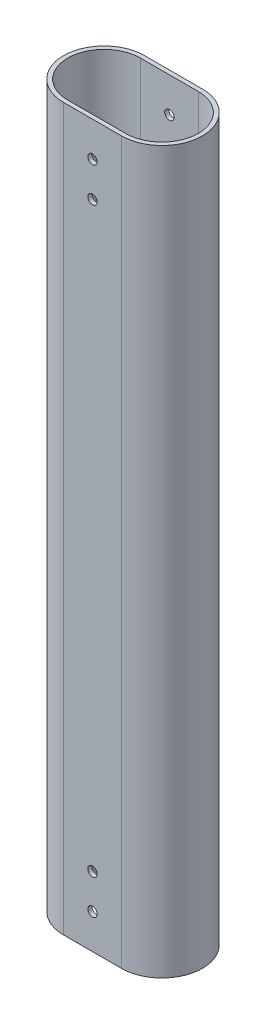
ISO-10303-21;
HEADER;
FILE_DESCRIPTION(('STEP AP214'),'2;1');
FILE_NAME('part.step','',(''),(''),'','','');
FILE_SCHEMA(('AUTOMOTIVE_DESIGN { 1 0 10303 214 1 1 1 1 }'));
ENDSEC;
DATA;
#1=APPLICATION_CONTEXT('core data for automotive mechanical design processes');
#2=APPLICATION_PROTOCOL_DEFINITION('international standard','automotive_design',2000,#1);
#3=PRODUCT_CONTEXT('',#1,'mechanical');
#4=PRODUCT('Part','Part','',(#3));
#5=PRODUCT_RELATED_PRODUCT_CATEGORY('part','',(#4));
#6=PRODUCT_DEFINITION_FORMATION('','',#4);
#7=PRODUCT_DEFINITION_CONTEXT('part definition',#1,'design');
#8=PRODUCT_DEFINITION('design','',#6,#7);
#9=PRODUCT_DEFINITION_SHAPE('','',#8);
#10=(LENGTH_UNIT() NAMED_UNIT(*) SI_UNIT(.MILLI.,.METRE.));
#11=(NAMED_UNIT(*) PLANE_ANGLE_UNIT() SI_UNIT($,.RADIAN.));
#12=(NAMED_UNIT(*) SI_UNIT($,.STERADIAN.) SOLID_ANGLE_UNIT());
#13=UNCERTAINTY_MEASURE_WITH_UNIT(LENGTH_MEASURE(1.E-05),#10,'distance_accuracy_value','');
#14=(GEOMETRIC_REPRESENTATION_CONTEXT(3) GLOBAL_UNCERTAINTY_ASSIGNED_CONTEXT((#13)) GLOBAL_UNIT_ASSIGNED_CONTEXT((#10,
#11,#12)) REPRESENTATION_CONTEXT('',''));
#15=CARTESIAN_POINT('',(0.,0.,0.));
#16=DIRECTION('',(0.,0.,1.));
#17=DIRECTION('',(1.,0.,0.));
#18=AXIS2_PLACEMENT_3D('',#15,#16,#17);
#19=CARTESIAN_POINT('',(12.5,311.4,0.));
#20=DIRECTION('',(0.,1.,0.));
#21=DIRECTION('',(0.,0.,1.));
#22=AXIS2_PLACEMENT_3D('',#19,#20,#21);
#23=PLANE('',#22);
#24=CARTESIAN_POINT('',(12.5,311.4,0.));
#25=DIRECTION('',(0.,1.,0.));
#26=DIRECTION('',(0.,0.,1.));
#27=AXIS2_PLACEMENT_3D('',#24,#25,#26);
#28=CIRCLE('',#27,17.5);
#29=CARTESIAN_POINT('',(12.5,311.4,17.5));
#30=VERTEX_POINT('',#29);
#31=CARTESIAN_POINT('',(12.5,311.4,-17.5));
#32=VERTEX_POINT('',#31);
#33=EDGE_CURVE('E139',#30,#32,#28,.T.);
#34=ORIENTED_EDGE('',*,*,#33,.T.);
#35=DIRECTION('',(-1.,0.,0.));
#36=VECTOR('',#35,1.);
#37=CARTESIAN_POINT('',(-12.5,311.4,-17.5));
#38=LINE('',#37,#36);
#39=CARTESIAN_POINT('',(-12.5,311.4,-17.5));
#40=VERTEX_POINT('',#39);
#41=EDGE_CURVE('E142',#32,#40,#38,.T.);
#42=ORIENTED_EDGE('',*,*,#41,.T.);
#43=CARTESIAN_POINT('',(-12.5,311.4,0.));
#44=DIRECTION('',(0.,1.,0.));
#45=DIRECTION('',(0.,0.,1.));
#46=AXIS2_PLACEMENT_3D('',#43,#44,#45);
#47=CIRCLE('',#46,17.5);
#48=CARTESIAN_POINT('',(-12.5,311.4,17.5));
#49=VERTEX_POINT('',#48);
#50=EDGE_CURVE('E145',#40,#49,#47,.T.);
#51=ORIENTED_EDGE('',*,*,#50,.T.);
#52=DIRECTION('',(1.,0.,0.));
#53=VECTOR('',#52,1.);
#54=CARTESIAN_POINT('',(-12.5,311.4,17.5));
#55=LINE('',#54,#53);
#56=EDGE_CURVE('E147',#49,#30,#55,.T.);
#57=ORIENTED_EDGE('',*,*,#56,.T.);
#58=EDGE_LOOP('',(#34,#42,#51,#57));
#59=FACE_BOUND('',#58,.T.);
#60=DIRECTION('',(1.,0.,0.));
#61=VECTOR('',#60,1.);
#62=CARTESIAN_POINT('',(-12.5,311.4,15.7));
#63=LINE('',#62,#61);
#64=CARTESIAN_POINT('',(-12.5,311.4,15.7));
#65=VERTEX_POINT('',#64);
#66=CARTESIAN_POINT('',(12.5,311.4,15.7));
#67=VERTEX_POINT('',#66);
#68=EDGE_CURVE('E109',#65,#67,#63,.T.);
#69=ORIENTED_EDGE('',*,*,#68,.F.);
#70=CARTESIAN_POINT('',(-12.5,311.4,0.));
#71=DIRECTION('',(0.,1.,0.));
#72=DIRECTION('',(0.,0.,1.));
#73=AXIS2_PLACEMENT_3D('',#70,#71,#72);
#74=CIRCLE('',#73,15.7);
#75=CARTESIAN_POINT('',(-12.5,311.4,-15.7));
#76=VERTEX_POINT('',#75);
#77=EDGE_CURVE('E101',#76,#65,#74,.T.);
#78=ORIENTED_EDGE('',*,*,#77,.F.);
#79=DIRECTION('',(-1.,0.,0.));
#80=VECTOR('',#79,1.);
#81=CARTESIAN_POINT('',(-12.5,311.4,-15.7));
#82=LINE('',#81,#80);
#83=CARTESIAN_POINT('',(12.5,311.4,-15.7));
#84=VERTEX_POINT('',#83);
#85=EDGE_CURVE('E123',#84,#76,#82,.T.);
#86=ORIENTED_EDGE('',*,*,#85,.F.);
#87=CARTESIAN_POINT('',(12.5,311.4,0.));
#88=DIRECTION('',(0.,1.,0.));
#89=DIRECTION('',(0.,0.,1.));
#90=AXIS2_PLACEMENT_3D('',#87,#88,#89);
#91=CIRCLE('',#90,15.7);
#92=EDGE_CURVE('E121',#67,#84,#91,.T.);
#93=ORIENTED_EDGE('',*,*,#92,.F.);
#94=EDGE_LOOP('',(#69,#78,#86,#93));
#95=FACE_BOUND('',#94,.T.);
#96=ADVANCED_FACE('F34',(#59,#95),#23,.T.);
#97=CARTESIAN_POINT('',(12.5,0.,0.));
#98=DIRECTION('',(0.,1.,0.));
#99=DIRECTION('',(0.,0.,1.));
#100=AXIS2_PLACEMENT_3D('',#97,#98,#99);
#101=PLANE('',#100);
#102=CARTESIAN_POINT('',(12.5,0.,0.));
#103=DIRECTION('',(0.,1.,0.));
#104=DIRECTION('',(0.,0.,1.));
#105=AXIS2_PLACEMENT_3D('',#102,#103,#104);
#106=CIRCLE('',#105,17.5);
#107=CARTESIAN_POINT('',(12.5,0.,17.5));
#108=VERTEX_POINT('',#107);
#109=CARTESIAN_POINT('',(12.5,0.,-17.5));
#110=VERTEX_POINT('',#109);
#111=EDGE_CURVE('E117',#108,#110,#106,.T.);
#112=ORIENTED_EDGE('',*,*,#111,.F.);
#113=DIRECTION('',(1.,0.,0.));
#114=VECTOR('',#113,1.);
#115=CARTESIAN_POINT('',(-12.5,0.,17.5));
#116=LINE('',#115,#114);
#117=CARTESIAN_POINT('',(-12.5,0.,17.5));
#118=VERTEX_POINT('',#117);
#119=EDGE_CURVE('E143',#118,#108,#116,.T.);
#120=ORIENTED_EDGE('',*,*,#119,.F.);
#121=CARTESIAN_POINT('',(-12.5,0.,0.));
#122=DIRECTION('',(0.,1.,0.));
#123=DIRECTION('',(0.,0.,1.));
#124=AXIS2_PLACEMENT_3D('',#121,#122,#123);
#125=CIRCLE('',#124,17.5);
#126=CARTESIAN_POINT('',(-12.5,0.,-17.5));
#127=VERTEX_POINT('',#126);
#128=EDGE_CURVE('E154',#127,#118,#125,.T.);
#129=ORIENTED_EDGE('',*,*,#128,.F.);
#130=DIRECTION('',(-1.,0.,0.));
#131=VECTOR('',#130,1.);
#132=CARTESIAN_POINT('',(-12.5,0.,-17.5));
#133=LINE('',#132,#131);
#134=EDGE_CURVE('E152',#110,#127,#133,.T.);
#135=ORIENTED_EDGE('',*,*,#134,.F.);
#136=EDGE_LOOP('',(#112,#120,#129,#135));
#137=FACE_BOUND('',#136,.T.);
#138=CARTESIAN_POINT('',(-12.5,0.,0.));
#139=DIRECTION('',(0.,1.,0.));
#140=DIRECTION('',(0.,0.,1.));
#141=AXIS2_PLACEMENT_3D('',#138,#139,#140);
#142=CIRCLE('',#141,15.7);
#143=CARTESIAN_POINT('',(-12.5,0.,-15.7));
#144=VERTEX_POINT('',#143);
#145=CARTESIAN_POINT('',(-12.5,0.,15.7));
#146=VERTEX_POINT('',#145);
#147=EDGE_CURVE('E59',#144,#146,#142,.T.);
#148=ORIENTED_EDGE('',*,*,#147,.T.);
#149=DIRECTION('',(1.,0.,0.));
#150=VECTOR('',#149,1.);
#151=CARTESIAN_POINT('',(-12.5,0.,15.7));
#152=LINE('',#151,#150);
#153=CARTESIAN_POINT('',(12.5,0.,15.7));
#154=VERTEX_POINT('',#153);
#155=EDGE_CURVE('E116',#146,#154,#152,.T.);
#156=ORIENTED_EDGE('',*,*,#155,.T.);
#157=CARTESIAN_POINT('',(12.5,0.,0.));
#158=DIRECTION('',(0.,1.,0.));
#159=DIRECTION('',(0.,0.,1.));
#160=AXIS2_PLACEMENT_3D('',#157,#158,#159);
#161=CIRCLE('',#160,15.7);
#162=CARTESIAN_POINT('',(12.5,0.,-15.7));
#163=VERTEX_POINT('',#162);
#164=EDGE_CURVE('E131',#154,#163,#161,.T.);
#165=ORIENTED_EDGE('',*,*,#164,.T.);
#166=DIRECTION('',(-1.,0.,0.));
#167=VECTOR('',#166,1.);
#168=CARTESIAN_POINT('',(-12.5,0.,-15.7));
#169=LINE('',#168,#167);
#170=EDGE_CURVE('E110',#163,#144,#169,.T.);
#171=ORIENTED_EDGE('',*,*,#170,.T.);
#172=EDGE_LOOP('',(#148,#156,#165,#171));
#173=FACE_BOUND('',#172,.T.);
#174=ADVANCED_FACE('F223',(#137,#173),#101,.F.);
#175=CARTESIAN_POINT('',(12.5,311.4,0.));
#176=DIRECTION('',(0.,-1.,0.));
#177=DIRECTION('',(0.,0.,-1.));
#178=AXIS2_PLACEMENT_3D('',#175,#176,#177);
#179=CYLINDRICAL_SURFACE('',#178,17.5);
#180=ORIENTED_EDGE('',*,*,#111,.T.);
#181=DIRECTION('',(0.,-1.,0.));
#182=VECTOR('',#181,1.);
#183=CARTESIAN_POINT('',(12.5,311.4,-17.5));
#184=LINE('',#183,#182);
#185=EDGE_CURVE('E11',#32,#110,#184,.T.);
#186=ORIENTED_EDGE('',*,*,#185,.F.);
#187=ORIENTED_EDGE('',*,*,#33,.F.);
#188=DIRECTION('',(0.,-1.,0.));
#189=VECTOR('',#188,1.);
#190=CARTESIAN_POINT('',(12.5,311.4,17.5));
#191=LINE('',#190,#189);
#192=EDGE_CURVE('E149',#30,#108,#191,.T.);
#193=ORIENTED_EDGE('',*,*,#192,.T.);
#194=EDGE_LOOP('',(#180,#186,#187,#193));
#195=FACE_BOUND('',#194,.T.);
#196=ADVANCED_FACE('F36',(#195),#179,.T.);
#197=CARTESIAN_POINT('',(-12.5,311.4,-17.5));
#198=DIRECTION('',(0.,0.,1.));
#199=DIRECTION('',(1.,0.,0.));
#200=AXIS2_PLACEMENT_3D('',#197,#198,#199);
#201=PLANE('',#200);
#202=CARTESIAN_POINT('',(0.,15.,-17.5));
#203=DIRECTION('',(0.,0.,1.));
#204=DIRECTION('',(1.,0.,0.));
#205=AXIS2_PLACEMENT_3D('',#202,#203,#204);
#206=CIRCLE('',#205,2.01929999999999);
#207=CARTESIAN_POINT('',(2.01929999999999,15.,-17.5));
#208=VERTEX_POINT('',#207);
#209=EDGE_CURVE('E247',#208,#208,#206,.T.);
#210=ORIENTED_EDGE('',*,*,#209,.T.);
#211=EDGE_LOOP('',(#210));
#212=FACE_BOUND('',#211,.T.);
#213=CARTESIAN_POINT('',(0.,30.,-17.5));
#214=DIRECTION('',(0.,0.,1.));
#215=DIRECTION('',(1.,0.,0.));
#216=AXIS2_PLACEMENT_3D('',#213,#214,#215);
#217=CIRCLE('',#216,2.01929999999999);
#218=CARTESIAN_POINT('',(2.01929999999999,30.,-17.5));
#219=VERTEX_POINT('',#218);
#220=EDGE_CURVE('E175',#219,#219,#217,.T.);
#221=ORIENTED_EDGE('',*,*,#220,.T.);
#222=EDGE_LOOP('',(#221));
#223=FACE_BOUND('',#222,.T.);
#224=CARTESIAN_POINT('',(0.,296.4,-17.5));
#225=DIRECTION('',(0.,0.,1.));
#226=DIRECTION('',(1.,0.,0.));
#227=AXIS2_PLACEMENT_3D('',#224,#225,#226);
#228=CIRCLE('',#227,2.01929999999999);
#229=CARTESIAN_POINT('',(2.01929999999999,296.4,-17.5));
#230=VERTEX_POINT('',#229);
#231=EDGE_CURVE('E171',#230,#230,#228,.T.);
#232=ORIENTED_EDGE('',*,*,#231,.T.);
#233=EDGE_LOOP('',(#232));
#234=FACE_BOUND('',#233,.T.);
#235=CARTESIAN_POINT('',(0.,281.4,-17.5));
#236=DIRECTION('',(0.,0.,1.));
#237=DIRECTION('',(1.,0.,0.));
#238=AXIS2_PLACEMENT_3D('',#235,#236,#237);
#239=CIRCLE('',#238,2.01929999999999);
#240=CARTESIAN_POINT('',(2.01929999999999,281.4,-17.5));
#241=VERTEX_POINT('',#240);
#242=EDGE_CURVE('E167',#241,#241,#239,.T.);
#243=ORIENTED_EDGE('',*,*,#242,.T.);
#244=EDGE_LOOP('',(#243));
#245=FACE_BOUND('',#244,.T.);
#246=ORIENTED_EDGE('',*,*,#134,.T.);
#247=DIRECTION('',(0.,-1.,0.));
#248=VECTOR('',#247,1.);
#249=CARTESIAN_POINT('',(-12.5,311.4,-17.5));
#250=LINE('',#249,#248);
#251=EDGE_CURVE('E43',#40,#127,#250,.T.);
#252=ORIENTED_EDGE('',*,*,#251,.F.);
#253=ORIENTED_EDGE('',*,*,#41,.F.);
#254=ORIENTED_EDGE('',*,*,#185,.T.);
#255=EDGE_LOOP('',(#246,#252,#253,#254));
#256=FACE_BOUND('',#255,.T.);
#257=ADVANCED_FACE('F237',(#212,#223,#234,#245,#256),#201,.F.);
#258=CARTESIAN_POINT('',(-12.5,311.4,0.));
#259=DIRECTION('',(0.,-1.,0.));
#260=DIRECTION('',(0.,0.,-1.));
#261=AXIS2_PLACEMENT_3D('',#258,#259,#260);
#262=CYLINDRICAL_SURFACE('',#261,17.5);
#263=ORIENTED_EDGE('',*,*,#128,.T.);
#264=DIRECTION('',(0.,-1.,0.));
#265=VECTOR('',#264,1.);
#266=CARTESIAN_POINT('',(-12.5,311.4,17.5));
#267=LINE('',#266,#265);
#268=EDGE_CURVE('E159',#49,#118,#267,.T.);
#269=ORIENTED_EDGE('',*,*,#268,.F.);
#270=ORIENTED_EDGE('',*,*,#50,.F.);
#271=ORIENTED_EDGE('',*,*,#251,.T.);
#272=EDGE_LOOP('',(#263,#269,#270,#271));
#273=FACE_BOUND('',#272,.T.);
#274=ADVANCED_FACE('F234',(#273),#262,.T.);
#275=CARTESIAN_POINT('',(-12.5,311.4,17.5));
#276=DIRECTION('',(0.,0.,-1.));
#277=DIRECTION('',(-1.,0.,0.));
#278=AXIS2_PLACEMENT_3D('',#275,#276,#277);
#279=PLANE('',#278);
#280=CARTESIAN_POINT('',(0.,15.,17.5));
#281=DIRECTION('',(0.,0.,1.));
#282=DIRECTION('',(1.,0.,0.));
#283=AXIS2_PLACEMENT_3D('',#280,#281,#282);
#284=CIRCLE('',#283,2.01929999999999);
#285=CARTESIAN_POINT('',(2.01929999999999,15.,17.5));
#286=VERTEX_POINT('',#285);
#287=EDGE_CURVE('E299',#286,#286,#284,.T.);
#288=ORIENTED_EDGE('',*,*,#287,.F.);
#289=EDGE_LOOP('',(#288));
#290=FACE_BOUND('',#289,.T.);
#291=CARTESIAN_POINT('',(0.,30.,17.5));
#292=DIRECTION('',(0.,0.,1.));
#293=DIRECTION('',(1.,0.,0.));
#294=AXIS2_PLACEMENT_3D('',#291,#292,#293);
#295=CIRCLE('',#294,2.01929999999999);
#296=CARTESIAN_POINT('',(2.01929999999999,30.,17.5));
#297=VERTEX_POINT('',#296);
#298=EDGE_CURVE('E182',#297,#297,#295,.T.);
#299=ORIENTED_EDGE('',*,*,#298,.F.);
#300=EDGE_LOOP('',(#299));
#301=FACE_BOUND('',#300,.T.);
#302=CARTESIAN_POINT('',(0.,296.4,17.5));
#303=DIRECTION('',(0.,0.,1.));
#304=DIRECTION('',(1.,0.,0.));
#305=AXIS2_PLACEMENT_3D('',#302,#303,#304);
#306=CIRCLE('',#305,2.01929999999999);
#307=CARTESIAN_POINT('',(2.01929999999999,296.4,17.5));
#308=VERTEX_POINT('',#307);
#309=EDGE_CURVE('E179',#308,#308,#306,.T.);
#310=ORIENTED_EDGE('',*,*,#309,.F.);
#311=EDGE_LOOP('',(#310));
#312=FACE_BOUND('',#311,.T.);
#313=CARTESIAN_POINT('',(0.,281.4,17.5));
#314=DIRECTION('',(0.,0.,1.));
#315=DIRECTION('',(1.,0.,0.));
#316=AXIS2_PLACEMENT_3D('',#313,#314,#315);
#317=CIRCLE('',#316,2.01929999999999);
#318=CARTESIAN_POINT('',(2.01929999999999,281.4,17.5));
#319=VERTEX_POINT('',#318);
#320=EDGE_CURVE('E197',#319,#319,#317,.T.);
#321=ORIENTED_EDGE('',*,*,#320,.F.);
#322=EDGE_LOOP('',(#321));
#323=FACE_BOUND('',#322,.T.);
#324=ORIENTED_EDGE('',*,*,#119,.T.);
#325=ORIENTED_EDGE('',*,*,#192,.F.);
#326=ORIENTED_EDGE('',*,*,#56,.F.);
#327=ORIENTED_EDGE('',*,*,#268,.T.);
#328=EDGE_LOOP('',(#324,#325,#326,#327));
#329=FACE_BOUND('',#328,.T.);
#330=ADVANCED_FACE('F218',(#290,#301,#312,#323,#329),#279,.F.);
#331=CARTESIAN_POINT('',(-12.5,311.4,0.));
#332=DIRECTION('',(0.,-1.,0.));
#333=DIRECTION('',(0.,0.,-1.));
#334=AXIS2_PLACEMENT_3D('',#331,#332,#333);
#335=CYLINDRICAL_SURFACE('',#334,15.7);
#336=ORIENTED_EDGE('',*,*,#147,.F.);
#337=DIRECTION('',(0.,-1.,0.));
#338=VECTOR('',#337,1.);
#339=CARTESIAN_POINT('',(-12.5,311.4,-15.7));
#340=LINE('',#339,#338);
#341=EDGE_CURVE('E105',#76,#144,#340,.T.);
#342=ORIENTED_EDGE('',*,*,#341,.F.);
#343=ORIENTED_EDGE('',*,*,#77,.T.);
#344=DIRECTION('',(0.,-1.,0.));
#345=VECTOR('',#344,1.);
#346=CARTESIAN_POINT('',(-12.5,311.4,15.7));
#347=LINE('',#346,#345);
#348=EDGE_CURVE('E104',#65,#146,#347,.T.);
#349=ORIENTED_EDGE('',*,*,#348,.T.);
#350=EDGE_LOOP('',(#336,#342,#343,#349));
#351=FACE_BOUND('',#350,.T.);
#352=ADVANCED_FACE('F103',(#351),#335,.F.);
#353=CARTESIAN_POINT('',(-12.5,311.4,15.7));
#354=DIRECTION('',(0.,0.,-1.));
#355=DIRECTION('',(-1.,0.,0.));
#356=AXIS2_PLACEMENT_3D('',#353,#354,#355);
#357=PLANE('',#356);
#358=CARTESIAN_POINT('',(0.,15.,15.7));
#359=DIRECTION('',(0.,0.,-1.));
#360=DIRECTION('',(-1.,0.,0.));
#361=AXIS2_PLACEMENT_3D('',#358,#359,#360);
#362=CIRCLE('',#361,2.01929999999999);
#363=CARTESIAN_POINT('',(-2.01929999999999,15.,15.7));
#364=VERTEX_POINT('',#363);
#365=EDGE_CURVE('E187',#364,#364,#362,.T.);
#366=ORIENTED_EDGE('',*,*,#365,.F.);
#367=EDGE_LOOP('',(#366));
#368=FACE_BOUND('',#367,.T.);
#369=CARTESIAN_POINT('',(0.,30.,15.7));
#370=DIRECTION('',(0.,0.,-1.));
#371=DIRECTION('',(-1.,0.,0.));
#372=AXIS2_PLACEMENT_3D('',#369,#370,#371);
#373=CIRCLE('',#372,2.01929999999999);
#374=CARTESIAN_POINT('',(-2.01929999999999,30.,15.7));
#375=VERTEX_POINT('',#374);
#376=EDGE_CURVE('E174',#375,#375,#373,.T.);
#377=ORIENTED_EDGE('',*,*,#376,.F.);
#378=EDGE_LOOP('',(#377));
#379=FACE_BOUND('',#378,.T.);
#380=CARTESIAN_POINT('',(0.,296.4,15.7));
#381=DIRECTION('',(0.,0.,-1.));
#382=DIRECTION('',(-1.,0.,0.));
#383=AXIS2_PLACEMENT_3D('',#380,#381,#382);
#384=CIRCLE('',#383,2.01929999999999);
#385=CARTESIAN_POINT('',(-2.01929999999999,296.4,15.7));
#386=VERTEX_POINT('',#385);
#387=EDGE_CURVE('E170',#386,#386,#384,.T.);
#388=ORIENTED_EDGE('',*,*,#387,.F.);
#389=EDGE_LOOP('',(#388));
#390=FACE_BOUND('',#389,.T.);
#391=CARTESIAN_POINT('',(0.,281.4,15.7));
#392=DIRECTION('',(0.,0.,-1.));
#393=DIRECTION('',(-1.,0.,0.));
#394=AXIS2_PLACEMENT_3D('',#391,#392,#393);
#395=CIRCLE('',#394,2.01929999999999);
#396=CARTESIAN_POINT('',(-2.01929999999999,281.4,15.7));
#397=VERTEX_POINT('',#396);
#398=EDGE_CURVE('E129',#397,#397,#395,.T.);
#399=ORIENTED_EDGE('',*,*,#398,.F.);
#400=EDGE_LOOP('',(#399));
#401=FACE_BOUND('',#400,.T.);
#402=ORIENTED_EDGE('',*,*,#155,.F.);
#403=ORIENTED_EDGE('',*,*,#348,.F.);
#404=ORIENTED_EDGE('',*,*,#68,.T.);
#405=DIRECTION('',(0.,-1.,0.));
#406=VECTOR('',#405,1.);
#407=CARTESIAN_POINT('',(12.5,311.4,15.7));
#408=LINE('',#407,#406);
#409=EDGE_CURVE('E118',#67,#154,#408,.T.);
#410=ORIENTED_EDGE('',*,*,#409,.T.);
#411=EDGE_LOOP('',(#402,#403,#404,#410));
#412=FACE_BOUND('',#411,.T.);
#413=ADVANCED_FACE('F113',(#368,#379,#390,#401,#412),#357,.T.);
#414=CARTESIAN_POINT('',(12.5,311.4,0.));
#415=DIRECTION('',(0.,-1.,0.));
#416=DIRECTION('',(0.,0.,-1.));
#417=AXIS2_PLACEMENT_3D('',#414,#415,#416);
#418=CYLINDRICAL_SURFACE('',#417,15.7);
#419=ORIENTED_EDGE('',*,*,#164,.F.);
#420=ORIENTED_EDGE('',*,*,#409,.F.);
#421=ORIENTED_EDGE('',*,*,#92,.T.);
#422=DIRECTION('',(0.,-1.,0.));
#423=VECTOR('',#422,1.);
#424=CARTESIAN_POINT('',(12.5,311.4,-15.7));
#425=LINE('',#424,#423);
#426=EDGE_CURVE('E51',#84,#163,#425,.T.);
#427=ORIENTED_EDGE('',*,*,#426,.T.);
#428=EDGE_LOOP('',(#419,#420,#421,#427));
#429=FACE_BOUND('',#428,.T.);
#430=ADVANCED_FACE('F208',(#429),#418,.F.);
#431=CARTESIAN_POINT('',(-12.5,311.4,-15.7));
#432=DIRECTION('',(0.,0.,1.));
#433=DIRECTION('',(1.,0.,0.));
#434=AXIS2_PLACEMENT_3D('',#431,#432,#433);
#435=PLANE('',#434);
#436=CARTESIAN_POINT('',(0.,15.,-15.7));
#437=DIRECTION('',(0.,0.,1.));
#438=DIRECTION('',(1.,0.,0.));
#439=AXIS2_PLACEMENT_3D('',#436,#437,#438);
#440=CIRCLE('',#439,2.01929999999999);
#441=CARTESIAN_POINT('',(2.01929999999999,15.,-15.7));
#442=VERTEX_POINT('',#441);
#443=EDGE_CURVE('E38',#442,#442,#440,.T.);
#444=ORIENTED_EDGE('',*,*,#443,.F.);
#445=EDGE_LOOP('',(#444));
#446=FACE_BOUND('',#445,.T.);
#447=CARTESIAN_POINT('',(0.,30.,-15.7));
#448=DIRECTION('',(0.,0.,1.));
#449=DIRECTION('',(1.,0.,0.));
#450=AXIS2_PLACEMENT_3D('',#447,#448,#449);
#451=CIRCLE('',#450,2.01929999999999);
#452=CARTESIAN_POINT('',(2.01929999999999,30.,-15.7));
#453=VERTEX_POINT('',#452);
#454=EDGE_CURVE('E172',#453,#453,#451,.T.);
#455=ORIENTED_EDGE('',*,*,#454,.F.);
#456=EDGE_LOOP('',(#455));
#457=FACE_BOUND('',#456,.T.);
#458=CARTESIAN_POINT('',(0.,296.4,-15.7));
#459=DIRECTION('',(0.,0.,1.));
#460=DIRECTION('',(1.,0.,0.));
#461=AXIS2_PLACEMENT_3D('',#458,#459,#460);
#462=CIRCLE('',#461,2.01929999999999);
#463=CARTESIAN_POINT('',(2.01929999999999,296.4,-15.7));
#464=VERTEX_POINT('',#463);
#465=EDGE_CURVE('E168',#464,#464,#462,.T.);
#466=ORIENTED_EDGE('',*,*,#465,.F.);
#467=EDGE_LOOP('',(#466));
#468=FACE_BOUND('',#467,.T.);
#469=CARTESIAN_POINT('',(0.,281.4,-15.7));
#470=DIRECTION('',(0.,0.,1.));
#471=DIRECTION('',(1.,0.,0.));
#472=AXIS2_PLACEMENT_3D('',#469,#470,#471);
#473=CIRCLE('',#472,2.01929999999999);
#474=CARTESIAN_POINT('',(2.01929999999999,281.4,-15.7));
#475=VERTEX_POINT('',#474);
#476=EDGE_CURVE('E164',#475,#475,#473,.T.);
#477=ORIENTED_EDGE('',*,*,#476,.F.);
#478=EDGE_LOOP('',(#477));
#479=FACE_BOUND('',#478,.T.);
#480=ORIENTED_EDGE('',*,*,#170,.F.);
#481=ORIENTED_EDGE('',*,*,#426,.F.);
#482=ORIENTED_EDGE('',*,*,#85,.T.);
#483=ORIENTED_EDGE('',*,*,#341,.T.);
#484=EDGE_LOOP('',(#480,#481,#482,#483));
#485=FACE_BOUND('',#484,.T.);
#486=ADVANCED_FACE('F215',(#446,#457,#468,#479,#485),#435,.T.);
#487=CARTESIAN_POINT('',(0.,281.4,17.5));
#488=DIRECTION('',(0.,0.,1.));
#489=DIRECTION('',(1.,0.,0.));
#490=AXIS2_PLACEMENT_3D('',#487,#488,#489);
#491=CYLINDRICAL_SURFACE('',#490,2.01929999999999);
#492=ORIENTED_EDGE('',*,*,#476,.T.);
#493=EDGE_LOOP('',(#492));
#494=FACE_BOUND('',#493,.T.);
#495=ORIENTED_EDGE('',*,*,#242,.F.);
#496=EDGE_LOOP('',(#495));
#497=FACE_BOUND('',#496,.T.);
#498=ADVANCED_FACE('F267',(#494,#497),#491,.F.);
#499=ORIENTED_EDGE('',*,*,#398,.T.);
#500=EDGE_LOOP('',(#499));
#501=FACE_BOUND('',#500,.T.);
#502=ORIENTED_EDGE('',*,*,#320,.T.);
#503=EDGE_LOOP('',(#502));
#504=FACE_BOUND('',#503,.T.);
#505=ADVANCED_FACE('F204',(#501,#504),#491,.F.);
#506=CARTESIAN_POINT('',(0.,296.4,17.5));
#507=DIRECTION('',(0.,0.,1.));
#508=DIRECTION('',(1.,0.,0.));
#509=AXIS2_PLACEMENT_3D('',#506,#507,#508);
#510=CYLINDRICAL_SURFACE('',#509,2.01929999999999);
#511=ORIENTED_EDGE('',*,*,#465,.T.);
#512=EDGE_LOOP('',(#511));
#513=FACE_BOUND('',#512,.T.);
#514=ORIENTED_EDGE('',*,*,#231,.F.);
#515=EDGE_LOOP('',(#514));
#516=FACE_BOUND('',#515,.T.);
#517=ADVANCED_FACE('F278',(#513,#516),#510,.F.);
#518=ORIENTED_EDGE('',*,*,#387,.T.);
#519=EDGE_LOOP('',(#518));
#520=FACE_BOUND('',#519,.T.);
#521=ORIENTED_EDGE('',*,*,#309,.T.);
#522=EDGE_LOOP('',(#521));
#523=FACE_BOUND('',#522,.T.);
#524=ADVANCED_FACE('F281',(#520,#523),#510,.F.);
#525=CARTESIAN_POINT('',(0.,30.,17.5));
#526=DIRECTION('',(0.,0.,1.));
#527=DIRECTION('',(1.,0.,0.));
#528=AXIS2_PLACEMENT_3D('',#525,#526,#527);
#529=CYLINDRICAL_SURFACE('',#528,2.01929999999999);
#530=ORIENTED_EDGE('',*,*,#454,.T.);
#531=EDGE_LOOP('',(#530));
#532=FACE_BOUND('',#531,.T.);
#533=ORIENTED_EDGE('',*,*,#220,.F.);
#534=EDGE_LOOP('',(#533));
#535=FACE_BOUND('',#534,.T.);
#536=ADVANCED_FACE('F283',(#532,#535),#529,.F.);
#537=ORIENTED_EDGE('',*,*,#376,.T.);
#538=EDGE_LOOP('',(#537));
#539=FACE_BOUND('',#538,.T.);
#540=ORIENTED_EDGE('',*,*,#298,.T.);
#541=EDGE_LOOP('',(#540));
#542=FACE_BOUND('',#541,.T.);
#543=ADVANCED_FACE('F286',(#539,#542),#529,.F.);
#544=CARTESIAN_POINT('',(0.,15.,17.5));
#545=DIRECTION('',(0.,0.,1.));
#546=DIRECTION('',(1.,0.,0.));
#547=AXIS2_PLACEMENT_3D('',#544,#545,#546);
#548=CYLINDRICAL_SURFACE('',#547,2.01929999999999);
#549=ORIENTED_EDGE('',*,*,#443,.T.);
#550=EDGE_LOOP('',(#549));
#551=FACE_BOUND('',#550,.T.);
#552=ORIENTED_EDGE('',*,*,#209,.F.);
#553=EDGE_LOOP('',(#552));
#554=FACE_BOUND('',#553,.T.);
#555=ADVANCED_FACE('F287',(#551,#554),#548,.F.);
#556=ORIENTED_EDGE('',*,*,#365,.T.);
#557=EDGE_LOOP('',(#556));
#558=FACE_BOUND('',#557,.T.);
#559=ORIENTED_EDGE('',*,*,#287,.T.);
#560=EDGE_LOOP('',(#559));
#561=FACE_BOUND('',#560,.T.);
#562=ADVANCED_FACE('F289',(#558,#561),#548,.F.);
#563=CLOSED_SHELL('',(#96,#174,#196,#257,#274,#330,#352,#413,#430,#486,#498,#505,#517,#524,#536,
#543,#555,#562));
#564=MANIFOLD_SOLID_BREP('B2',#563);
#565=ADVANCED_BREP_SHAPE_REPRESENTATION('',(#18,#564),#14);
#566=SHAPE_DEFINITION_REPRESENTATION(#9,#565);
ENDSEC;
END-ISO-10303-21;
